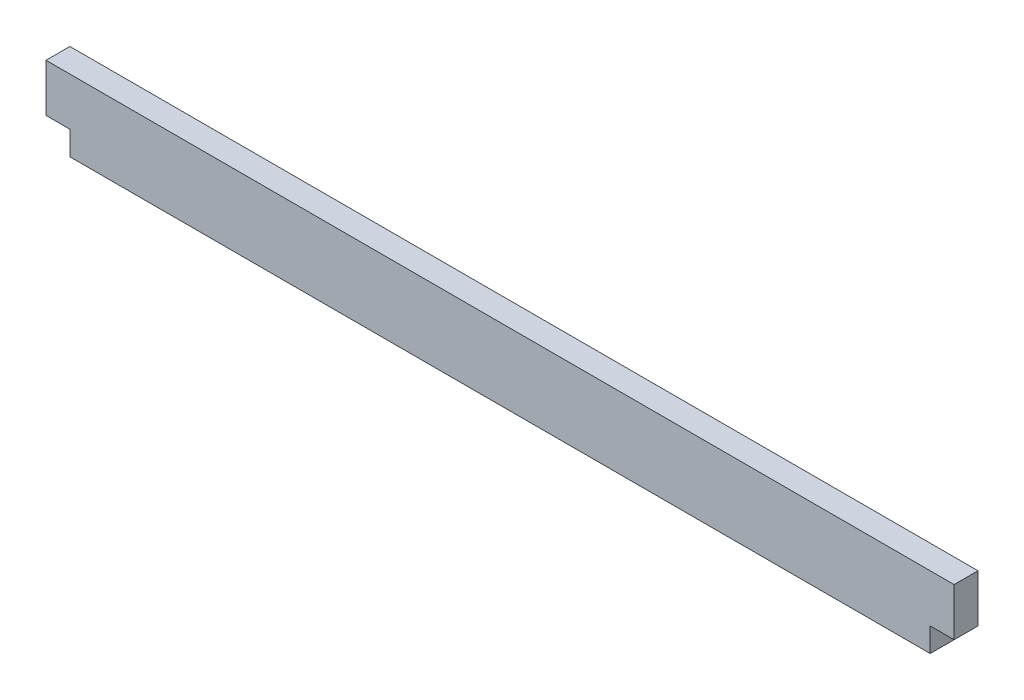
ISO-10303-21;
HEADER;
FILE_DESCRIPTION(('STEP AP214'),'2;1');
FILE_NAME('part.step','',(''),(''),'','','');
FILE_SCHEMA(('AUTOMOTIVE_DESIGN { 1 0 10303 214 1 1 1 1 }'));
ENDSEC;
DATA;
#1=APPLICATION_CONTEXT('core data for automotive mechanical design processes');
#2=APPLICATION_PROTOCOL_DEFINITION('international standard','automotive_design',2000,#1);
#3=PRODUCT_CONTEXT('',#1,'mechanical');
#4=PRODUCT('Part','Part','',(#3));
#5=PRODUCT_RELATED_PRODUCT_CATEGORY('part','',(#4));
#6=PRODUCT_DEFINITION_FORMATION('','',#4);
#7=PRODUCT_DEFINITION_CONTEXT('part definition',#1,'design');
#8=PRODUCT_DEFINITION('design','',#6,#7);
#9=PRODUCT_DEFINITION_SHAPE('','',#8);
#10=(LENGTH_UNIT() NAMED_UNIT(*) SI_UNIT(.MILLI.,.METRE.));
#11=(NAMED_UNIT(*) PLANE_ANGLE_UNIT() SI_UNIT($,.RADIAN.));
#12=(NAMED_UNIT(*) SI_UNIT($,.STERADIAN.) SOLID_ANGLE_UNIT());
#13=UNCERTAINTY_MEASURE_WITH_UNIT(LENGTH_MEASURE(1.E-05),#10,'distance_accuracy_value','');
#14=(GEOMETRIC_REPRESENTATION_CONTEXT(3) GLOBAL_UNCERTAINTY_ASSIGNED_CONTEXT((#13)) GLOBAL_UNIT_ASSIGNED_CONTEXT((#10,
#11,#12)) REPRESENTATION_CONTEXT('',''));
#15=CARTESIAN_POINT('',(0.,0.,0.));
#16=DIRECTION('',(0.,0.,1.));
#17=DIRECTION('',(1.,0.,0.));
#18=AXIS2_PLACEMENT_3D('',#15,#16,#17);
#19=CARTESIAN_POINT('',(-28.7478312925297,3.175,3.175));
#20=DIRECTION('',(1.,0.,0.));
#21=DIRECTION('',(0.,0.,-1.));
#22=AXIS2_PLACEMENT_3D('',#19,#20,#21);
#23=PLANE('',#22);
#24=DIRECTION('',(0.,-1.,0.));
#25=VECTOR('',#24,1.);
#26=CARTESIAN_POINT('',(-28.7478312925297,3.175,0.));
#27=LINE('',#26,#25);
#28=CARTESIAN_POINT('',(-28.7478312925297,9.525,0.));
#29=VERTEX_POINT('',#28);
#30=CARTESIAN_POINT('',(-28.7478312925297,3.175,0.));
#31=VERTEX_POINT('',#30);
#32=EDGE_CURVE('E129',#29,#31,#27,.T.);
#33=ORIENTED_EDGE('',*,*,#32,.T.);
#34=DIRECTION('',(0.,0.,-1.));
#35=VECTOR('',#34,1.);
#36=CARTESIAN_POINT('',(-28.7478312925297,3.175,3.175));
#37=LINE('',#36,#35);
#38=CARTESIAN_POINT('',(-28.7478312925297,3.175,3.175));
#39=VERTEX_POINT('',#38);
#40=EDGE_CURVE('E11',#39,#31,#37,.T.);
#41=ORIENTED_EDGE('',*,*,#40,.F.);
#42=DIRECTION('',(0.,-1.,0.));
#43=VECTOR('',#42,1.);
#44=CARTESIAN_POINT('',(-28.7478312925297,3.175,3.175));
#45=LINE('',#44,#43);
#46=CARTESIAN_POINT('',(-28.7478312925297,9.525,3.175));
#47=VERTEX_POINT('',#46);
#48=EDGE_CURVE('E143',#47,#39,#45,.T.);
#49=ORIENTED_EDGE('',*,*,#48,.F.);
#50=DIRECTION('',(0.,0.,-1.));
#51=VECTOR('',#50,1.);
#52=CARTESIAN_POINT('',(-28.7478312925297,9.525,3.175));
#53=LINE('',#52,#51);
#54=EDGE_CURVE('E125',#47,#29,#53,.T.);
#55=ORIENTED_EDGE('',*,*,#54,.T.);
#56=EDGE_LOOP('',(#33,#41,#49,#55));
#57=FACE_BOUND('',#56,.T.);
#58=ADVANCED_FACE('F33',(#57),#23,.F.);
#59=CARTESIAN_POINT('',(-28.7478312925297,3.175,3.175));
#60=DIRECTION('',(0.,1.,0.));
#61=DIRECTION('',(0.,0.,1.));
#62=AXIS2_PLACEMENT_3D('',#59,#60,#61);
#63=PLANE('',#62);
#64=DIRECTION('',(1.,0.,0.));
#65=VECTOR('',#64,1.);
#66=CARTESIAN_POINT('',(-28.7478312925297,3.175,0.));
#67=LINE('',#66,#65);
#68=CARTESIAN_POINT('',(-25.5728312925297,3.175,0.));
#69=VERTEX_POINT('',#68);
#70=EDGE_CURVE('E132',#31,#69,#67,.T.);
#71=ORIENTED_EDGE('',*,*,#70,.T.);
#72=DIRECTION('',(0.,0.,-1.));
#73=VECTOR('',#72,1.);
#74=CARTESIAN_POINT('',(-25.5728312925297,3.175,3.175));
#75=LINE('',#74,#73);
#76=CARTESIAN_POINT('',(-25.5728312925297,3.175,3.175));
#77=VERTEX_POINT('',#76);
#78=EDGE_CURVE('E41',#77,#69,#75,.T.);
#79=ORIENTED_EDGE('',*,*,#78,.F.);
#80=DIRECTION('',(1.,0.,0.));
#81=VECTOR('',#80,1.);
#82=CARTESIAN_POINT('',(-28.7478312925297,3.175,3.175));
#83=LINE('',#82,#81);
#84=EDGE_CURVE('E92',#39,#77,#83,.T.);
#85=ORIENTED_EDGE('',*,*,#84,.F.);
#86=ORIENTED_EDGE('',*,*,#40,.T.);
#87=EDGE_LOOP('',(#71,#79,#85,#86));
#88=FACE_BOUND('',#87,.T.);
#89=ADVANCED_FACE('F178',(#88),#63,.F.);
#90=CARTESIAN_POINT('',(-25.5728312925297,0.,3.175));
#91=DIRECTION('',(1.,0.,0.));
#92=DIRECTION('',(0.,0.,-1.));
#93=AXIS2_PLACEMENT_3D('',#90,#91,#92);
#94=PLANE('',#93);
#95=DIRECTION('',(0.,-1.,0.));
#96=VECTOR('',#95,1.);
#97=CARTESIAN_POINT('',(-25.5728312925297,0.,0.));
#98=LINE('',#97,#96);
#99=CARTESIAN_POINT('',(-25.5728312925297,0.,0.));
#100=VERTEX_POINT('',#99);
#101=EDGE_CURVE('E134',#69,#100,#98,.T.);
#102=ORIENTED_EDGE('',*,*,#101,.T.);
#103=DIRECTION('',(0.,0.,-1.));
#104=VECTOR('',#103,1.);
#105=CARTESIAN_POINT('',(-25.5728312925297,0.,3.175));
#106=LINE('',#105,#104);
#107=CARTESIAN_POINT('',(-25.5728312925297,0.,3.175));
#108=VERTEX_POINT('',#107);
#109=EDGE_CURVE('E150',#108,#100,#106,.T.);
#110=ORIENTED_EDGE('',*,*,#109,.F.);
#111=DIRECTION('',(0.,-1.,0.));
#112=VECTOR('',#111,1.);
#113=CARTESIAN_POINT('',(-25.5728312925297,0.,3.175));
#114=LINE('',#113,#112);
#115=EDGE_CURVE('E158',#77,#108,#114,.T.);
#116=ORIENTED_EDGE('',*,*,#115,.F.);
#117=ORIENTED_EDGE('',*,*,#78,.T.);
#118=EDGE_LOOP('',(#102,#110,#116,#117));
#119=FACE_BOUND('',#118,.T.);
#120=ADVANCED_FACE('F156',(#119),#94,.F.);
#121=CARTESIAN_POINT('',(88.7271687074703,0.,3.175));
#122=DIRECTION('',(0.,1.,0.));
#123=DIRECTION('',(-1.,0.,0.));
#124=AXIS2_PLACEMENT_3D('',#121,#122,#123);
#125=PLANE('',#124);
#126=DIRECTION('',(1.,0.,0.));
#127=VECTOR('',#126,1.);
#128=CARTESIAN_POINT('',(88.7271687074703,0.,0.));
#129=LINE('',#128,#127);
#130=CARTESIAN_POINT('',(88.7271687074703,0.,0.));
#131=VERTEX_POINT('',#130);
#132=EDGE_CURVE('E136',#100,#131,#129,.T.);
#133=ORIENTED_EDGE('',*,*,#132,.T.);
#134=DIRECTION('',(0.,0.,-1.));
#135=VECTOR('',#134,1.);
#136=CARTESIAN_POINT('',(88.7271687074703,0.,3.175));
#137=LINE('',#136,#135);
#138=CARTESIAN_POINT('',(88.7271687074703,0.,3.175));
#139=VERTEX_POINT('',#138);
#140=EDGE_CURVE('E147',#139,#131,#137,.T.);
#141=ORIENTED_EDGE('',*,*,#140,.F.);
#142=DIRECTION('',(1.,0.,0.));
#143=VECTOR('',#142,1.);
#144=CARTESIAN_POINT('',(88.7271687074703,0.,3.175));
#145=LINE('',#144,#143);
#146=EDGE_CURVE('E170',#108,#139,#145,.T.);
#147=ORIENTED_EDGE('',*,*,#146,.F.);
#148=ORIENTED_EDGE('',*,*,#109,.T.);
#149=EDGE_LOOP('',(#133,#141,#147,#148));
#150=FACE_BOUND('',#149,.T.);
#151=ADVANCED_FACE('F166',(#150),#125,.F.);
#152=CARTESIAN_POINT('',(88.7271687074703,0.,3.175));
#153=DIRECTION('',(-1.,0.,0.));
#154=DIRECTION('',(0.,-1.,0.));
#155=AXIS2_PLACEMENT_3D('',#152,#153,#154);
#156=PLANE('',#155);
#157=DIRECTION('',(0.,1.,0.));
#158=VECTOR('',#157,1.);
#159=CARTESIAN_POINT('',(88.7271687074703,0.,0.));
#160=LINE('',#159,#158);
#161=CARTESIAN_POINT('',(88.7271687074703,3.17500000000001,0.));
#162=VERTEX_POINT('',#161);
#163=EDGE_CURVE('E138',#131,#162,#160,.T.);
#164=ORIENTED_EDGE('',*,*,#163,.T.);
#165=DIRECTION('',(0.,0.,-1.));
#166=VECTOR('',#165,1.);
#167=CARTESIAN_POINT('',(88.7271687074703,3.17500000000001,3.175));
#168=LINE('',#167,#166);
#169=CARTESIAN_POINT('',(88.7271687074703,3.17500000000001,3.175));
#170=VERTEX_POINT('',#169);
#171=EDGE_CURVE('E120',#170,#162,#168,.T.);
#172=ORIENTED_EDGE('',*,*,#171,.F.);
#173=DIRECTION('',(0.,1.,0.));
#174=VECTOR('',#173,1.);
#175=CARTESIAN_POINT('',(88.7271687074703,0.,3.175));
#176=LINE('',#175,#174);
#177=EDGE_CURVE('E111',#139,#170,#176,.T.);
#178=ORIENTED_EDGE('',*,*,#177,.F.);
#179=ORIENTED_EDGE('',*,*,#140,.T.);
#180=EDGE_LOOP('',(#164,#172,#178,#179));
#181=FACE_BOUND('',#180,.T.);
#182=ADVANCED_FACE('F169',(#181),#156,.F.);
#183=CARTESIAN_POINT('',(91.9021687074703,3.17500000000001,3.175));
#184=DIRECTION('',(0.,1.,0.));
#185=DIRECTION('',(-1.,0.,0.));
#186=AXIS2_PLACEMENT_3D('',#183,#184,#185);
#187=PLANE('',#186);
#188=DIRECTION('',(1.,0.,0.));
#189=VECTOR('',#188,1.);
#190=CARTESIAN_POINT('',(91.9021687074703,3.17500000000001,0.));
#191=LINE('',#190,#189);
#192=CARTESIAN_POINT('',(91.9021687074703,3.17500000000001,0.));
#193=VERTEX_POINT('',#192);
#194=EDGE_CURVE('E119',#162,#193,#191,.T.);
#195=ORIENTED_EDGE('',*,*,#194,.T.);
#196=DIRECTION('',(0.,0.,-1.));
#197=VECTOR('',#196,1.);
#198=CARTESIAN_POINT('',(91.9021687074703,3.17500000000001,3.175));
#199=LINE('',#198,#197);
#200=CARTESIAN_POINT('',(91.9021687074703,3.17500000000001,3.175));
#201=VERTEX_POINT('',#200);
#202=EDGE_CURVE('E116',#201,#193,#199,.T.);
#203=ORIENTED_EDGE('',*,*,#202,.F.);
#204=DIRECTION('',(1.,0.,0.));
#205=VECTOR('',#204,1.);
#206=CARTESIAN_POINT('',(91.9021687074703,3.17500000000001,3.175));
#207=LINE('',#206,#205);
#208=EDGE_CURVE('E105',#170,#201,#207,.T.);
#209=ORIENTED_EDGE('',*,*,#208,.F.);
#210=ORIENTED_EDGE('',*,*,#171,.T.);
#211=EDGE_LOOP('',(#195,#203,#209,#210));
#212=FACE_BOUND('',#211,.T.);
#213=ADVANCED_FACE('F117',(#212),#187,.F.);
#214=CARTESIAN_POINT('',(91.9021687074703,3.17500000000001,3.175));
#215=DIRECTION('',(-1.,0.,0.));
#216=DIRECTION('',(0.,0.,1.));
#217=AXIS2_PLACEMENT_3D('',#214,#215,#216);
#218=PLANE('',#217);
#219=DIRECTION('',(0.,1.,0.));
#220=VECTOR('',#219,1.);
#221=CARTESIAN_POINT('',(91.9021687074703,3.17500000000001,0.));
#222=LINE('',#221,#220);
#223=CARTESIAN_POINT('',(91.9021687074703,9.52500000000001,0.));
#224=VERTEX_POINT('',#223);
#225=EDGE_CURVE('E78',#193,#224,#222,.T.);
#226=ORIENTED_EDGE('',*,*,#225,.T.);
#227=DIRECTION('',(0.,0.,-1.));
#228=VECTOR('',#227,1.);
#229=CARTESIAN_POINT('',(91.9021687074703,9.52500000000001,3.175));
#230=LINE('',#229,#228);
#231=CARTESIAN_POINT('',(91.9021687074703,9.52500000000001,3.175));
#232=VERTEX_POINT('',#231);
#233=EDGE_CURVE('E121',#232,#224,#230,.T.);
#234=ORIENTED_EDGE('',*,*,#233,.F.);
#235=DIRECTION('',(0.,1.,0.));
#236=VECTOR('',#235,1.);
#237=CARTESIAN_POINT('',(91.9021687074703,3.17500000000001,3.175));
#238=LINE('',#237,#236);
#239=EDGE_CURVE('E109',#201,#232,#238,.T.);
#240=ORIENTED_EDGE('',*,*,#239,.F.);
#241=ORIENTED_EDGE('',*,*,#202,.T.);
#242=EDGE_LOOP('',(#226,#234,#240,#241));
#243=FACE_BOUND('',#242,.T.);
#244=ADVANCED_FACE('F123',(#243),#218,.F.);
#245=CARTESIAN_POINT('',(91.9021687074703,9.52500000000001,3.175));
#246=DIRECTION('',(0.,-1.,0.));
#247=DIRECTION('',(1.,0.,0.));
#248=AXIS2_PLACEMENT_3D('',#245,#246,#247);
#249=PLANE('',#248);
#250=DIRECTION('',(-1.,0.,0.));
#251=VECTOR('',#250,1.);
#252=CARTESIAN_POINT('',(91.9021687074703,9.52500000000001,0.));
#253=LINE('',#252,#251);
#254=EDGE_CURVE('E84',#224,#29,#253,.T.);
#255=ORIENTED_EDGE('',*,*,#254,.T.);
#256=ORIENTED_EDGE('',*,*,#54,.F.);
#257=DIRECTION('',(-1.,0.,0.));
#258=VECTOR('',#257,1.);
#259=CARTESIAN_POINT('',(91.9021687074703,9.52500000000001,3.175));
#260=LINE('',#259,#258);
#261=EDGE_CURVE('E49',#232,#47,#260,.T.);
#262=ORIENTED_EDGE('',*,*,#261,.F.);
#263=ORIENTED_EDGE('',*,*,#233,.T.);
#264=EDGE_LOOP('',(#255,#256,#262,#263));
#265=FACE_BOUND('',#264,.T.);
#266=ADVANCED_FACE('F194',(#265),#249,.F.);
#267=CARTESIAN_POINT('',(0.,0.,3.175));
#268=DIRECTION('',(0.,0.,1.));
#269=DIRECTION('',(1.,0.,0.));
#270=AXIS2_PLACEMENT_3D('',#267,#268,#269);
#271=PLANE('',#270);
#272=ORIENTED_EDGE('',*,*,#48,.T.);
#273=ORIENTED_EDGE('',*,*,#84,.T.);
#274=ORIENTED_EDGE('',*,*,#115,.T.);
#275=ORIENTED_EDGE('',*,*,#146,.T.);
#276=ORIENTED_EDGE('',*,*,#177,.T.);
#277=ORIENTED_EDGE('',*,*,#208,.T.);
#278=ORIENTED_EDGE('',*,*,#239,.T.);
#279=ORIENTED_EDGE('',*,*,#261,.T.);
#280=EDGE_LOOP('',(#272,#273,#274,#275,#276,#277,#278,#279));
#281=FACE_BOUND('',#280,.T.);
#282=ADVANCED_FACE('F107',(#281),#271,.T.);
#283=CARTESIAN_POINT('',(0.,0.,0.));
#284=DIRECTION('',(0.,0.,1.));
#285=DIRECTION('',(1.,0.,0.));
#286=AXIS2_PLACEMENT_3D('',#283,#284,#285);
#287=PLANE('',#286);
#288=ORIENTED_EDGE('',*,*,#32,.F.);
#289=ORIENTED_EDGE('',*,*,#254,.F.);
#290=ORIENTED_EDGE('',*,*,#225,.F.);
#291=ORIENTED_EDGE('',*,*,#194,.F.);
#292=ORIENTED_EDGE('',*,*,#163,.F.);
#293=ORIENTED_EDGE('',*,*,#132,.F.);
#294=ORIENTED_EDGE('',*,*,#101,.F.);
#295=ORIENTED_EDGE('',*,*,#70,.F.);
#296=EDGE_LOOP('',(#288,#289,#290,#291,#292,#293,#294,#295));
#297=FACE_BOUND('',#296,.T.);
#298=ADVANCED_FACE('F162',(#297),#287,.F.);
#299=CLOSED_SHELL('',(#58,#89,#120,#151,#182,#213,#244,#266,#282,#298));
#300=MANIFOLD_SOLID_BREP('B2',#299);
#301=ADVANCED_BREP_SHAPE_REPRESENTATION('',(#18,#300),#14);
#302=SHAPE_DEFINITION_REPRESENTATION(#9,#301);
ENDSEC;
END-ISO-10303-21;
